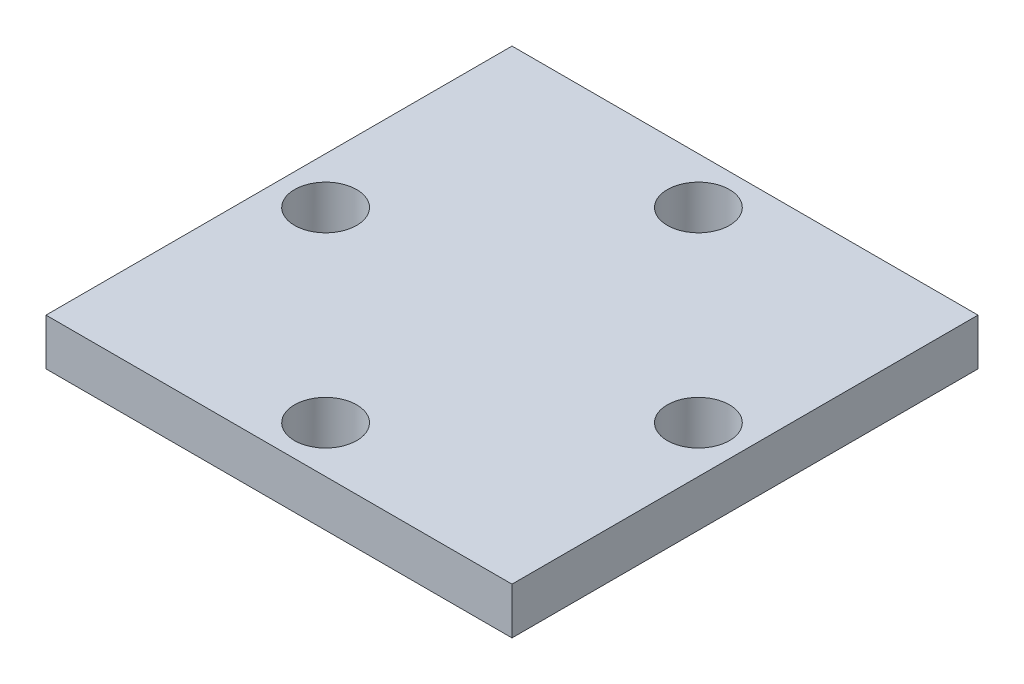
ISO-10303-21;
HEADER;
FILE_DESCRIPTION(('STEP AP214'),'2;1');
FILE_NAME('part.step','',(''),(''),'','','');
FILE_SCHEMA(('AUTOMOTIVE_DESIGN { 1 0 10303 214 1 1 1 1 }'));
ENDSEC;
DATA;
#1=APPLICATION_CONTEXT('core data for automotive mechanical design processes');
#2=APPLICATION_PROTOCOL_DEFINITION('international standard','automotive_design',2000,#1);
#3=PRODUCT_CONTEXT('',#1,'mechanical');
#4=PRODUCT('Part','Part','',(#3));
#5=PRODUCT_RELATED_PRODUCT_CATEGORY('part','',(#4));
#6=PRODUCT_DEFINITION_FORMATION('','',#4);
#7=PRODUCT_DEFINITION_CONTEXT('part definition',#1,'design');
#8=PRODUCT_DEFINITION('design','',#6,#7);
#9=PRODUCT_DEFINITION_SHAPE('','',#8);
#10=(LENGTH_UNIT() NAMED_UNIT(*) SI_UNIT(.MILLI.,.METRE.));
#11=(NAMED_UNIT(*) PLANE_ANGLE_UNIT() SI_UNIT($,.RADIAN.));
#12=(NAMED_UNIT(*) SI_UNIT($,.STERADIAN.) SOLID_ANGLE_UNIT());
#13=UNCERTAINTY_MEASURE_WITH_UNIT(LENGTH_MEASURE(1.E-05),#10,'distance_accuracy_value','');
#14=(GEOMETRIC_REPRESENTATION_CONTEXT(3) GLOBAL_UNCERTAINTY_ASSIGNED_CONTEXT((#13)) GLOBAL_UNIT_ASSIGNED_CONTEXT((#10,
#11,#12)) REPRESENTATION_CONTEXT('',''));
#15=CARTESIAN_POINT('',(0.,0.,0.));
#16=DIRECTION('',(0.,0.,1.));
#17=DIRECTION('',(1.,0.,0.));
#18=AXIS2_PLACEMENT_3D('',#15,#16,#17);
#19=CARTESIAN_POINT('',(-15.,3.,-15.));
#20=DIRECTION('',(1.,0.,0.));
#21=DIRECTION('',(0.,0.,-1.));
#22=AXIS2_PLACEMENT_3D('',#19,#20,#21);
#23=PLANE('',#22);
#24=DIRECTION('',(0.,0.,1.));
#25=VECTOR('',#24,1.);
#26=CARTESIAN_POINT('',(-15.,0.,-15.));
#27=LINE('',#26,#25);
#28=CARTESIAN_POINT('',(-15.,0.,-15.));
#29=VERTEX_POINT('',#28);
#30=CARTESIAN_POINT('',(-15.,0.,15.));
#31=VERTEX_POINT('',#30);
#32=EDGE_CURVE('E99',#29,#31,#27,.T.);
#33=ORIENTED_EDGE('',*,*,#32,.T.);
#34=DIRECTION('',(0.,-1.,0.));
#35=VECTOR('',#34,1.);
#36=CARTESIAN_POINT('',(-15.,3.,15.));
#37=LINE('',#36,#35);
#38=CARTESIAN_POINT('',(-15.,3.,15.));
#39=VERTEX_POINT('',#38);
#40=EDGE_CURVE('E11',#39,#31,#37,.T.);
#41=ORIENTED_EDGE('',*,*,#40,.F.);
#42=DIRECTION('',(0.,0.,1.));
#43=VECTOR('',#42,1.);
#44=CARTESIAN_POINT('',(-15.,3.,-15.));
#45=LINE('',#44,#43);
#46=CARTESIAN_POINT('',(-15.,3.,-15.));
#47=VERTEX_POINT('',#46);
#48=EDGE_CURVE('E86',#47,#39,#45,.T.);
#49=ORIENTED_EDGE('',*,*,#48,.F.);
#50=DIRECTION('',(0.,-1.,0.));
#51=VECTOR('',#50,1.);
#52=CARTESIAN_POINT('',(-15.,3.,-15.));
#53=LINE('',#52,#51);
#54=EDGE_CURVE('E95',#47,#29,#53,.T.);
#55=ORIENTED_EDGE('',*,*,#54,.T.);
#56=EDGE_LOOP('',(#33,#41,#49,#55));
#57=FACE_BOUND('',#56,.T.);
#58=ADVANCED_FACE('F33',(#57),#23,.F.);
#59=CARTESIAN_POINT('',(15.,3.,15.));
#60=DIRECTION('',(0.,0.,-1.));
#61=DIRECTION('',(-1.,0.,0.));
#62=AXIS2_PLACEMENT_3D('',#59,#60,#61);
#63=PLANE('',#62);
#64=DIRECTION('',(1.,0.,0.));
#65=VECTOR('',#64,1.);
#66=CARTESIAN_POINT('',(15.,0.,15.));
#67=LINE('',#66,#65);
#68=CARTESIAN_POINT('',(15.,0.,15.));
#69=VERTEX_POINT('',#68);
#70=EDGE_CURVE('E90',#31,#69,#67,.T.);
#71=ORIENTED_EDGE('',*,*,#70,.T.);
#72=DIRECTION('',(0.,-1.,0.));
#73=VECTOR('',#72,1.);
#74=CARTESIAN_POINT('',(15.,3.,15.));
#75=LINE('',#74,#73);
#76=CARTESIAN_POINT('',(15.,3.,15.));
#77=VERTEX_POINT('',#76);
#78=EDGE_CURVE('E42',#77,#69,#75,.T.);
#79=ORIENTED_EDGE('',*,*,#78,.F.);
#80=DIRECTION('',(1.,0.,0.));
#81=VECTOR('',#80,1.);
#82=CARTESIAN_POINT('',(15.,3.,15.));
#83=LINE('',#82,#81);
#84=EDGE_CURVE('E81',#39,#77,#83,.T.);
#85=ORIENTED_EDGE('',*,*,#84,.F.);
#86=ORIENTED_EDGE('',*,*,#40,.T.);
#87=EDGE_LOOP('',(#71,#79,#85,#86));
#88=FACE_BOUND('',#87,.T.);
#89=ADVANCED_FACE('F89',(#88),#63,.F.);
#90=CARTESIAN_POINT('',(15.,3.,-15.));
#91=DIRECTION('',(-1.,0.,0.));
#92=DIRECTION('',(0.,0.,1.));
#93=AXIS2_PLACEMENT_3D('',#90,#91,#92);
#94=PLANE('',#93);
#95=DIRECTION('',(0.,0.,-1.));
#96=VECTOR('',#95,1.);
#97=CARTESIAN_POINT('',(15.,0.,-15.));
#98=LINE('',#97,#96);
#99=CARTESIAN_POINT('',(15.,0.,-15.));
#100=VERTEX_POINT('',#99);
#101=EDGE_CURVE('E68',#69,#100,#98,.T.);
#102=ORIENTED_EDGE('',*,*,#101,.T.);
#103=DIRECTION('',(0.,-1.,0.));
#104=VECTOR('',#103,1.);
#105=CARTESIAN_POINT('',(15.,3.,-15.));
#106=LINE('',#105,#104);
#107=CARTESIAN_POINT('',(15.,3.,-15.));
#108=VERTEX_POINT('',#107);
#109=EDGE_CURVE('E91',#108,#100,#106,.T.);
#110=ORIENTED_EDGE('',*,*,#109,.F.);
#111=DIRECTION('',(0.,0.,-1.));
#112=VECTOR('',#111,1.);
#113=CARTESIAN_POINT('',(15.,3.,-15.));
#114=LINE('',#113,#112);
#115=EDGE_CURVE('E84',#77,#108,#114,.T.);
#116=ORIENTED_EDGE('',*,*,#115,.F.);
#117=ORIENTED_EDGE('',*,*,#78,.T.);
#118=EDGE_LOOP('',(#102,#110,#116,#117));
#119=FACE_BOUND('',#118,.T.);
#120=ADVANCED_FACE('F93',(#119),#94,.F.);
#121=CARTESIAN_POINT('',(15.,3.,-15.));
#122=DIRECTION('',(0.,0.,1.));
#123=DIRECTION('',(1.,0.,0.));
#124=AXIS2_PLACEMENT_3D('',#121,#122,#123);
#125=PLANE('',#124);
#126=DIRECTION('',(-1.,0.,0.));
#127=VECTOR('',#126,1.);
#128=CARTESIAN_POINT('',(15.,0.,-15.));
#129=LINE('',#128,#127);
#130=EDGE_CURVE('E74',#100,#29,#129,.T.);
#131=ORIENTED_EDGE('',*,*,#130,.T.);
#132=ORIENTED_EDGE('',*,*,#54,.F.);
#133=DIRECTION('',(-1.,0.,0.));
#134=VECTOR('',#133,1.);
#135=CARTESIAN_POINT('',(15.,3.,-15.));
#136=LINE('',#135,#134);
#137=EDGE_CURVE('E51',#108,#47,#136,.T.);
#138=ORIENTED_EDGE('',*,*,#137,.F.);
#139=ORIENTED_EDGE('',*,*,#109,.T.);
#140=EDGE_LOOP('',(#131,#132,#138,#139));
#141=FACE_BOUND('',#140,.T.);
#142=ADVANCED_FACE('F136',(#141),#125,.F.);
#143=CARTESIAN_POINT('',(0.,3.,0.));
#144=DIRECTION('',(0.,-1.,0.));
#145=DIRECTION('',(0.,0.,-1.));
#146=AXIS2_PLACEMENT_3D('',#143,#144,#145);
#147=PLANE('',#146);
#148=CARTESIAN_POINT('',(0.,3.,12.));
#149=DIRECTION('',(0.,1.,0.));
#150=DIRECTION('',(0.,0.,1.));
#151=AXIS2_PLACEMENT_3D('',#148,#149,#150);
#152=CIRCLE('',#151,2.);
#153=CARTESIAN_POINT('',(0.,3.,14.));
#154=VERTEX_POINT('',#153);
#155=EDGE_CURVE('E126',#154,#154,#152,.T.);
#156=ORIENTED_EDGE('',*,*,#155,.F.);
#157=EDGE_LOOP('',(#156));
#158=FACE_BOUND('',#157,.T.);
#159=CARTESIAN_POINT('',(0.,3.,-12.));
#160=DIRECTION('',(0.,1.,0.));
#161=DIRECTION('',(0.,0.,1.));
#162=AXIS2_PLACEMENT_3D('',#159,#160,#161);
#163=CIRCLE('',#162,2.);
#164=CARTESIAN_POINT('',(0.,3.,-10.));
#165=VERTEX_POINT('',#164);
#166=EDGE_CURVE('E116',#165,#165,#163,.T.);
#167=ORIENTED_EDGE('',*,*,#166,.F.);
#168=EDGE_LOOP('',(#167));
#169=FACE_BOUND('',#168,.T.);
#170=CARTESIAN_POINT('',(12.,3.,0.));
#171=DIRECTION('',(0.,1.,0.));
#172=DIRECTION('',(0.,0.,1.));
#173=AXIS2_PLACEMENT_3D('',#170,#171,#172);
#174=CIRCLE('',#173,2.);
#175=CARTESIAN_POINT('',(12.,3.,2.));
#176=VERTEX_POINT('',#175);
#177=EDGE_CURVE('E113',#176,#176,#174,.T.);
#178=ORIENTED_EDGE('',*,*,#177,.F.);
#179=EDGE_LOOP('',(#178));
#180=FACE_BOUND('',#179,.T.);
#181=CARTESIAN_POINT('',(-12.,3.,0.));
#182=DIRECTION('',(0.,1.,0.));
#183=DIRECTION('',(0.,0.,1.));
#184=AXIS2_PLACEMENT_3D('',#181,#182,#183);
#185=CIRCLE('',#184,2.);
#186=CARTESIAN_POINT('',(-12.,3.,2.));
#187=VERTEX_POINT('',#186);
#188=EDGE_CURVE('E110',#187,#187,#185,.T.);
#189=ORIENTED_EDGE('',*,*,#188,.F.);
#190=EDGE_LOOP('',(#189));
#191=FACE_BOUND('',#190,.T.);
#192=ORIENTED_EDGE('',*,*,#48,.T.);
#193=ORIENTED_EDGE('',*,*,#84,.T.);
#194=ORIENTED_EDGE('',*,*,#115,.T.);
#195=ORIENTED_EDGE('',*,*,#137,.T.);
#196=EDGE_LOOP('',(#192,#193,#194,#195));
#197=FACE_BOUND('',#196,.T.);
#198=ADVANCED_FACE('F82',(#158,#169,#180,#191,#197),#147,.F.);
#199=CARTESIAN_POINT('',(0.,0.,0.));
#200=DIRECTION('',(0.,-1.,0.));
#201=DIRECTION('',(0.,0.,-1.));
#202=AXIS2_PLACEMENT_3D('',#199,#200,#201);
#203=PLANE('',#202);
#204=CARTESIAN_POINT('',(0.,0.,12.));
#205=DIRECTION('',(0.,-1.,0.));
#206=DIRECTION('',(0.,0.,-1.));
#207=AXIS2_PLACEMENT_3D('',#204,#205,#206);
#208=CIRCLE('',#207,2.);
#209=CARTESIAN_POINT('',(0.,0.,10.));
#210=VERTEX_POINT('',#209);
#211=EDGE_CURVE('E36',#210,#210,#208,.T.);
#212=ORIENTED_EDGE('',*,*,#211,.F.);
#213=EDGE_LOOP('',(#212));
#214=FACE_BOUND('',#213,.T.);
#215=CARTESIAN_POINT('',(0.,0.,-12.));
#216=DIRECTION('',(0.,-1.,0.));
#217=DIRECTION('',(0.,0.,-1.));
#218=AXIS2_PLACEMENT_3D('',#215,#216,#217);
#219=CIRCLE('',#218,2.);
#220=CARTESIAN_POINT('',(0.,0.,-14.));
#221=VERTEX_POINT('',#220);
#222=EDGE_CURVE('E114',#221,#221,#219,.T.);
#223=ORIENTED_EDGE('',*,*,#222,.F.);
#224=EDGE_LOOP('',(#223));
#225=FACE_BOUND('',#224,.T.);
#226=CARTESIAN_POINT('',(12.,0.,0.));
#227=DIRECTION('',(0.,-1.,0.));
#228=DIRECTION('',(0.,0.,-1.));
#229=AXIS2_PLACEMENT_3D('',#226,#227,#228);
#230=CIRCLE('',#229,2.);
#231=CARTESIAN_POINT('',(12.,0.,-2.));
#232=VERTEX_POINT('',#231);
#233=EDGE_CURVE('E111',#232,#232,#230,.T.);
#234=ORIENTED_EDGE('',*,*,#233,.F.);
#235=EDGE_LOOP('',(#234));
#236=FACE_BOUND('',#235,.T.);
#237=CARTESIAN_POINT('',(-12.,0.,0.));
#238=DIRECTION('',(0.,-1.,0.));
#239=DIRECTION('',(0.,0.,-1.));
#240=AXIS2_PLACEMENT_3D('',#237,#238,#239);
#241=CIRCLE('',#240,2.);
#242=CARTESIAN_POINT('',(-12.,0.,-2.));
#243=VERTEX_POINT('',#242);
#244=EDGE_CURVE('E102',#243,#243,#241,.T.);
#245=ORIENTED_EDGE('',*,*,#244,.F.);
#246=EDGE_LOOP('',(#245));
#247=FACE_BOUND('',#246,.T.);
#248=ORIENTED_EDGE('',*,*,#32,.F.);
#249=ORIENTED_EDGE('',*,*,#130,.F.);
#250=ORIENTED_EDGE('',*,*,#101,.F.);
#251=ORIENTED_EDGE('',*,*,#70,.F.);
#252=EDGE_LOOP('',(#248,#249,#250,#251));
#253=FACE_BOUND('',#252,.T.);
#254=ADVANCED_FACE('F135',(#214,#225,#236,#247,#253),#203,.T.);
#255=CARTESIAN_POINT('',(-12.,-2.,0.));
#256=DIRECTION('',(0.,1.,0.));
#257=DIRECTION('',(0.,0.,1.));
#258=AXIS2_PLACEMENT_3D('',#255,#256,#257);
#259=CYLINDRICAL_SURFACE('',#258,2.);
#260=ORIENTED_EDGE('',*,*,#244,.T.);
#261=EDGE_LOOP('',(#260));
#262=FACE_BOUND('',#261,.T.);
#263=ORIENTED_EDGE('',*,*,#188,.T.);
#264=EDGE_LOOP('',(#263));
#265=FACE_BOUND('',#264,.T.);
#266=ADVANCED_FACE('F132',(#262,#265),#259,.F.);
#267=CARTESIAN_POINT('',(12.,-2.,0.));
#268=DIRECTION('',(0.,1.,0.));
#269=DIRECTION('',(0.,0.,1.));
#270=AXIS2_PLACEMENT_3D('',#267,#268,#269);
#271=CYLINDRICAL_SURFACE('',#270,2.);
#272=ORIENTED_EDGE('',*,*,#233,.T.);
#273=EDGE_LOOP('',(#272));
#274=FACE_BOUND('',#273,.T.);
#275=ORIENTED_EDGE('',*,*,#177,.T.);
#276=EDGE_LOOP('',(#275));
#277=FACE_BOUND('',#276,.T.);
#278=ADVANCED_FACE('F185',(#274,#277),#271,.F.);
#279=CARTESIAN_POINT('',(0.,-2.,-12.));
#280=DIRECTION('',(0.,1.,0.));
#281=DIRECTION('',(0.,0.,1.));
#282=AXIS2_PLACEMENT_3D('',#279,#280,#281);
#283=CYLINDRICAL_SURFACE('',#282,2.);
#284=ORIENTED_EDGE('',*,*,#222,.T.);
#285=EDGE_LOOP('',(#284));
#286=FACE_BOUND('',#285,.T.);
#287=ORIENTED_EDGE('',*,*,#166,.T.);
#288=EDGE_LOOP('',(#287));
#289=FACE_BOUND('',#288,.T.);
#290=ADVANCED_FACE('F194',(#286,#289),#283,.F.);
#291=CARTESIAN_POINT('',(0.,-2.,12.));
#292=DIRECTION('',(0.,1.,0.));
#293=DIRECTION('',(0.,0.,1.));
#294=AXIS2_PLACEMENT_3D('',#291,#292,#293);
#295=CYLINDRICAL_SURFACE('',#294,2.);
#296=ORIENTED_EDGE('',*,*,#211,.T.);
#297=EDGE_LOOP('',(#296));
#298=FACE_BOUND('',#297,.T.);
#299=ORIENTED_EDGE('',*,*,#155,.T.);
#300=EDGE_LOOP('',(#299));
#301=FACE_BOUND('',#300,.T.);
#302=ADVANCED_FACE('F204',(#298,#301),#295,.F.);
#303=CLOSED_SHELL('',(#58,#89,#120,#142,#198,#254,#266,#278,#290,#302));
#304=MANIFOLD_SOLID_BREP('B2',#303);
#305=ADVANCED_BREP_SHAPE_REPRESENTATION('',(#18,#304),#14);
#306=SHAPE_DEFINITION_REPRESENTATION(#9,#305);
ENDSEC;
END-ISO-10303-21;
